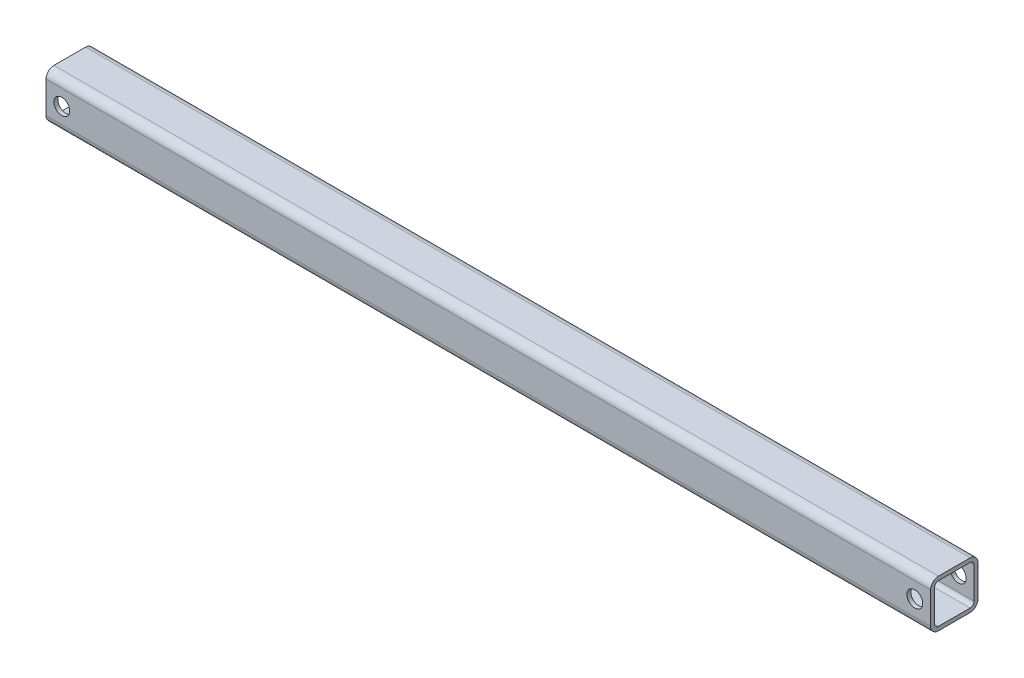
ISO-10303-21;
HEADER;
FILE_DESCRIPTION(('STEP AP214'),'2;1');
FILE_NAME('part.step','',(''),(''),'','','');
FILE_SCHEMA(('AUTOMOTIVE_DESIGN { 1 0 10303 214 1 1 1 1 }'));
ENDSEC;
DATA;
#1=APPLICATION_CONTEXT('core data for automotive mechanical design processes');
#2=APPLICATION_PROTOCOL_DEFINITION('international standard','automotive_design',2000,#1);
#3=PRODUCT_CONTEXT('',#1,'mechanical');
#4=PRODUCT('Part','Part','',(#3));
#5=PRODUCT_RELATED_PRODUCT_CATEGORY('part','',(#4));
#6=PRODUCT_DEFINITION_FORMATION('','',#4);
#7=PRODUCT_DEFINITION_CONTEXT('part definition',#1,'design');
#8=PRODUCT_DEFINITION('design','',#6,#7);
#9=PRODUCT_DEFINITION_SHAPE('','',#8);
#10=(LENGTH_UNIT() NAMED_UNIT(*) SI_UNIT(.MILLI.,.METRE.));
#11=(NAMED_UNIT(*) PLANE_ANGLE_UNIT() SI_UNIT($,.RADIAN.));
#12=(NAMED_UNIT(*) SI_UNIT($,.STERADIAN.) SOLID_ANGLE_UNIT());
#13=UNCERTAINTY_MEASURE_WITH_UNIT(LENGTH_MEASURE(1.E-05),#10,'distance_accuracy_value','');
#14=(GEOMETRIC_REPRESENTATION_CONTEXT(3) GLOBAL_UNCERTAINTY_ASSIGNED_CONTEXT((#13)) GLOBAL_UNIT_ASSIGNED_CONTEXT((#10,
#11,#12)) REPRESENTATION_CONTEXT('',''));
#15=CARTESIAN_POINT('',(0.,0.,0.));
#16=DIRECTION('',(0.,0.,1.));
#17=DIRECTION('',(1.,0.,0.));
#18=AXIS2_PLACEMENT_3D('',#15,#16,#17);
#19=CARTESIAN_POINT('',(711.2,12.7,-12.7));
#20=DIRECTION('',(-1.,0.,0.));
#21=DIRECTION('',(0.,0.,1.));
#22=AXIS2_PLACEMENT_3D('',#19,#20,#21);
#23=CYLINDRICAL_SURFACE('',#22,6.35);
#24=CARTESIAN_POINT('',(0.,12.7,-12.7));
#25=DIRECTION('',(1.,0.,0.));
#26=DIRECTION('',(0.,0.,-1.));
#27=AXIS2_PLACEMENT_3D('',#24,#25,#26);
#28=CIRCLE('',#27,6.35);
#29=CARTESIAN_POINT('',(0.,12.7,-19.05));
#30=VERTEX_POINT('',#29);
#31=CARTESIAN_POINT('',(0.,19.05,-12.7));
#32=VERTEX_POINT('',#31);
#33=EDGE_CURVE('E236',#30,#32,#28,.T.);
#34=ORIENTED_EDGE('',*,*,#33,.T.);
#35=DIRECTION('',(-1.,0.,0.));
#36=VECTOR('',#35,1.);
#37=CARTESIAN_POINT('',(711.2,19.05,-12.7));
#38=LINE('',#37,#36);
#39=CARTESIAN_POINT('',(711.2,19.05,-12.7));
#40=VERTEX_POINT('',#39);
#41=EDGE_CURVE('E12',#40,#32,#38,.T.);
#42=ORIENTED_EDGE('',*,*,#41,.F.);
#43=CARTESIAN_POINT('',(711.2,12.7,-12.7));
#44=DIRECTION('',(1.,0.,0.));
#45=DIRECTION('',(0.,0.,-1.));
#46=AXIS2_PLACEMENT_3D('',#43,#44,#45);
#47=CIRCLE('',#46,6.35);
#48=CARTESIAN_POINT('',(711.2,12.7,-19.05));
#49=VERTEX_POINT('',#48);
#50=EDGE_CURVE('E314',#49,#40,#47,.T.);
#51=ORIENTED_EDGE('',*,*,#50,.F.);
#52=DIRECTION('',(-1.,0.,0.));
#53=VECTOR('',#52,1.);
#54=CARTESIAN_POINT('',(711.2,12.7,-19.05));
#55=LINE('',#54,#53);
#56=EDGE_CURVE('E251',#49,#30,#55,.T.);
#57=ORIENTED_EDGE('',*,*,#56,.T.);
#58=EDGE_LOOP('',(#34,#42,#51,#57));
#59=FACE_BOUND('',#58,.T.);
#60=ADVANCED_FACE('F63',(#59),#23,.T.);
#61=CARTESIAN_POINT('',(711.2,19.05,-12.7));
#62=DIRECTION('',(0.,-1.,0.));
#63=DIRECTION('',(0.,0.,-1.));
#64=AXIS2_PLACEMENT_3D('',#61,#62,#63);
#65=PLANE('',#64);
#66=DIRECTION('',(0.,0.,1.));
#67=VECTOR('',#66,1.);
#68=CARTESIAN_POINT('',(0.,19.05,-12.7));
#69=LINE('',#68,#67);
#70=CARTESIAN_POINT('',(0.,19.05,12.7));
#71=VERTEX_POINT('',#70);
#72=EDGE_CURVE('E239',#32,#71,#69,.T.);
#73=ORIENTED_EDGE('',*,*,#72,.T.);
#74=DIRECTION('',(-1.,0.,0.));
#75=VECTOR('',#74,1.);
#76=CARTESIAN_POINT('',(711.2,19.05,12.7));
#77=LINE('',#76,#75);
#78=CARTESIAN_POINT('',(711.2,19.05,12.7));
#79=VERTEX_POINT('',#78);
#80=EDGE_CURVE('E73',#79,#71,#77,.T.);
#81=ORIENTED_EDGE('',*,*,#80,.F.);
#82=DIRECTION('',(0.,0.,1.));
#83=VECTOR('',#82,1.);
#84=CARTESIAN_POINT('',(711.2,19.05,-12.7));
#85=LINE('',#84,#83);
#86=EDGE_CURVE('E316',#40,#79,#85,.T.);
#87=ORIENTED_EDGE('',*,*,#86,.F.);
#88=ORIENTED_EDGE('',*,*,#41,.T.);
#89=EDGE_LOOP('',(#73,#81,#87,#88));
#90=FACE_BOUND('',#89,.T.);
#91=ADVANCED_FACE('F354',(#90),#65,.F.);
#92=CARTESIAN_POINT('',(711.2,12.7,12.7));
#93=DIRECTION('',(-1.,0.,0.));
#94=DIRECTION('',(0.,0.,1.));
#95=AXIS2_PLACEMENT_3D('',#92,#93,#94);
#96=CYLINDRICAL_SURFACE('',#95,6.35);
#97=CARTESIAN_POINT('',(0.,12.7,12.7));
#98=DIRECTION('',(1.,0.,0.));
#99=DIRECTION('',(0.,0.,-1.));
#100=AXIS2_PLACEMENT_3D('',#97,#98,#99);
#101=CIRCLE('',#100,6.35);
#102=CARTESIAN_POINT('',(0.,12.7,19.05));
#103=VERTEX_POINT('',#102);
#104=EDGE_CURVE('E241',#71,#103,#101,.T.);
#105=ORIENTED_EDGE('',*,*,#104,.T.);
#106=DIRECTION('',(-1.,0.,0.));
#107=VECTOR('',#106,1.);
#108=CARTESIAN_POINT('',(711.2,12.7,19.05));
#109=LINE('',#108,#107);
#110=CARTESIAN_POINT('',(711.2,12.7,19.05));
#111=VERTEX_POINT('',#110);
#112=EDGE_CURVE('E258',#111,#103,#109,.T.);
#113=ORIENTED_EDGE('',*,*,#112,.F.);
#114=CARTESIAN_POINT('',(711.2,12.7,12.7));
#115=DIRECTION('',(1.,0.,0.));
#116=DIRECTION('',(0.,0.,-1.));
#117=AXIS2_PLACEMENT_3D('',#114,#115,#116);
#118=CIRCLE('',#117,6.35);
#119=EDGE_CURVE('E318',#79,#111,#118,.T.);
#120=ORIENTED_EDGE('',*,*,#119,.F.);
#121=ORIENTED_EDGE('',*,*,#80,.T.);
#122=EDGE_LOOP('',(#105,#113,#120,#121));
#123=FACE_BOUND('',#122,.T.);
#124=ADVANCED_FACE('F359',(#123),#96,.T.);
#125=CARTESIAN_POINT('',(711.2,-12.7,19.05));
#126=DIRECTION('',(0.,0.,-1.));
#127=DIRECTION('',(0.,1.,0.));
#128=AXIS2_PLACEMENT_3D('',#125,#126,#127);
#129=PLANE('',#128);
#130=CARTESIAN_POINT('',(698.5,0.,19.05));
#131=DIRECTION('',(0.,0.,1.));
#132=DIRECTION('',(1.,0.,0.));
#133=AXIS2_PLACEMENT_3D('',#130,#131,#132);
#134=CIRCLE('',#133,6.34999999999994);
#135=CARTESIAN_POINT('',(704.85,0.,19.05));
#136=VERTEX_POINT('',#135);
#137=EDGE_CURVE('E525',#136,#136,#134,.T.);
#138=ORIENTED_EDGE('',*,*,#137,.F.);
#139=EDGE_LOOP('',(#138));
#140=FACE_BOUND('',#139,.T.);
#141=CARTESIAN_POINT('',(12.7,0.,19.05));
#142=DIRECTION('',(0.,0.,1.));
#143=DIRECTION('',(1.,0.,0.));
#144=AXIS2_PLACEMENT_3D('',#141,#142,#143);
#145=CIRCLE('',#144,6.35);
#146=CARTESIAN_POINT('',(19.05,0.,19.05));
#147=VERTEX_POINT('',#146);
#148=EDGE_CURVE('E534',#147,#147,#145,.T.);
#149=ORIENTED_EDGE('',*,*,#148,.F.);
#150=EDGE_LOOP('',(#149));
#151=FACE_BOUND('',#150,.T.);
#152=DIRECTION('',(0.,-1.,0.));
#153=VECTOR('',#152,1.);
#154=CARTESIAN_POINT('',(0.,-12.7,19.05));
#155=LINE('',#154,#153);
#156=CARTESIAN_POINT('',(0.,-12.7,19.05));
#157=VERTEX_POINT('',#156);
#158=EDGE_CURVE('E243',#103,#157,#155,.T.);
#159=ORIENTED_EDGE('',*,*,#158,.T.);
#160=DIRECTION('',(-1.,0.,0.));
#161=VECTOR('',#160,1.);
#162=CARTESIAN_POINT('',(711.2,-12.7,19.05));
#163=LINE('',#162,#161);
#164=CARTESIAN_POINT('',(711.2,-12.7,19.05));
#165=VERTEX_POINT('',#164);
#166=EDGE_CURVE('E255',#165,#157,#163,.T.);
#167=ORIENTED_EDGE('',*,*,#166,.F.);
#168=DIRECTION('',(0.,-1.,0.));
#169=VECTOR('',#168,1.);
#170=CARTESIAN_POINT('',(711.2,-12.7,19.05));
#171=LINE('',#170,#169);
#172=EDGE_CURVE('E320',#111,#165,#171,.T.);
#173=ORIENTED_EDGE('',*,*,#172,.F.);
#174=ORIENTED_EDGE('',*,*,#112,.T.);
#175=EDGE_LOOP('',(#159,#167,#173,#174));
#176=FACE_BOUND('',#175,.T.);
#177=ADVANCED_FACE('F326',(#140,#151,#176),#129,.F.);
#178=CARTESIAN_POINT('',(711.2,-12.7,12.7));
#179=DIRECTION('',(-1.,0.,0.));
#180=DIRECTION('',(0.,0.,1.));
#181=AXIS2_PLACEMENT_3D('',#178,#179,#180);
#182=CYLINDRICAL_SURFACE('',#181,6.35);
#183=CARTESIAN_POINT('',(0.,-12.7,12.7));
#184=DIRECTION('',(1.,0.,0.));
#185=DIRECTION('',(0.,0.,-1.));
#186=AXIS2_PLACEMENT_3D('',#183,#184,#185);
#187=CIRCLE('',#186,6.35);
#188=CARTESIAN_POINT('',(0.,-19.05,12.7));
#189=VERTEX_POINT('',#188);
#190=EDGE_CURVE('E245',#157,#189,#187,.T.);
#191=ORIENTED_EDGE('',*,*,#190,.T.);
#192=DIRECTION('',(-1.,0.,0.));
#193=VECTOR('',#192,1.);
#194=CARTESIAN_POINT('',(711.2,-19.05,12.7));
#195=LINE('',#194,#193);
#196=CARTESIAN_POINT('',(711.2,-19.05,12.7));
#197=VERTEX_POINT('',#196);
#198=EDGE_CURVE('E202',#197,#189,#195,.T.);
#199=ORIENTED_EDGE('',*,*,#198,.F.);
#200=CARTESIAN_POINT('',(711.2,-12.7,12.7));
#201=DIRECTION('',(1.,0.,0.));
#202=DIRECTION('',(0.,0.,-1.));
#203=AXIS2_PLACEMENT_3D('',#200,#201,#202);
#204=CIRCLE('',#203,6.35);
#205=EDGE_CURVE('E193',#165,#197,#204,.T.);
#206=ORIENTED_EDGE('',*,*,#205,.F.);
#207=ORIENTED_EDGE('',*,*,#166,.T.);
#208=EDGE_LOOP('',(#191,#199,#206,#207));
#209=FACE_BOUND('',#208,.T.);
#210=ADVANCED_FACE('F330',(#209),#182,.T.);
#211=CARTESIAN_POINT('',(711.2,-19.05,12.7));
#212=DIRECTION('',(0.,1.,0.));
#213=DIRECTION('',(0.,0.,1.));
#214=AXIS2_PLACEMENT_3D('',#211,#212,#213);
#215=PLANE('',#214);
#216=DIRECTION('',(0.,0.,-1.));
#217=VECTOR('',#216,1.);
#218=CARTESIAN_POINT('',(0.,-19.05,12.7));
#219=LINE('',#218,#217);
#220=CARTESIAN_POINT('',(0.,-19.05,-12.7));
#221=VERTEX_POINT('',#220);
#222=EDGE_CURVE('E201',#189,#221,#219,.T.);
#223=ORIENTED_EDGE('',*,*,#222,.T.);
#224=DIRECTION('',(-1.,0.,0.));
#225=VECTOR('',#224,1.);
#226=CARTESIAN_POINT('',(711.2,-19.05,-12.7));
#227=LINE('',#226,#225);
#228=CARTESIAN_POINT('',(711.2,-19.05,-12.7));
#229=VERTEX_POINT('',#228);
#230=EDGE_CURVE('E198',#229,#221,#227,.T.);
#231=ORIENTED_EDGE('',*,*,#230,.F.);
#232=DIRECTION('',(0.,0.,-1.));
#233=VECTOR('',#232,1.);
#234=CARTESIAN_POINT('',(711.2,-19.05,12.7));
#235=LINE('',#234,#233);
#236=EDGE_CURVE('E187',#197,#229,#235,.T.);
#237=ORIENTED_EDGE('',*,*,#236,.F.);
#238=ORIENTED_EDGE('',*,*,#198,.T.);
#239=EDGE_LOOP('',(#223,#231,#237,#238));
#240=FACE_BOUND('',#239,.T.);
#241=ADVANCED_FACE('F199',(#240),#215,.F.);
#242=CARTESIAN_POINT('',(711.2,-12.7,-12.7));
#243=DIRECTION('',(-1.,0.,0.));
#244=DIRECTION('',(0.,0.,1.));
#245=AXIS2_PLACEMENT_3D('',#242,#243,#244);
#246=CYLINDRICAL_SURFACE('',#245,6.35);
#247=CARTESIAN_POINT('',(0.,-12.7,-12.7));
#248=DIRECTION('',(1.,0.,0.));
#249=DIRECTION('',(0.,0.,-1.));
#250=AXIS2_PLACEMENT_3D('',#247,#248,#249);
#251=CIRCLE('',#250,6.35);
#252=CARTESIAN_POINT('',(0.,-12.7,-19.05));
#253=VERTEX_POINT('',#252);
#254=EDGE_CURVE('E135',#221,#253,#251,.T.);
#255=ORIENTED_EDGE('',*,*,#254,.T.);
#256=DIRECTION('',(-1.,0.,0.));
#257=VECTOR('',#256,1.);
#258=CARTESIAN_POINT('',(711.2,-12.7,-19.05));
#259=LINE('',#258,#257);
#260=CARTESIAN_POINT('',(711.2,-12.7,-19.05));
#261=VERTEX_POINT('',#260);
#262=EDGE_CURVE('E203',#261,#253,#259,.T.);
#263=ORIENTED_EDGE('',*,*,#262,.F.);
#264=CARTESIAN_POINT('',(711.2,-12.7,-12.7));
#265=DIRECTION('',(1.,0.,0.));
#266=DIRECTION('',(0.,0.,-1.));
#267=AXIS2_PLACEMENT_3D('',#264,#265,#266);
#268=CIRCLE('',#267,6.35);
#269=EDGE_CURVE('E191',#229,#261,#268,.T.);
#270=ORIENTED_EDGE('',*,*,#269,.F.);
#271=ORIENTED_EDGE('',*,*,#230,.T.);
#272=EDGE_LOOP('',(#255,#263,#270,#271));
#273=FACE_BOUND('',#272,.T.);
#274=ADVANCED_FACE('F205',(#273),#246,.T.);
#275=CARTESIAN_POINT('',(711.2,12.7,12.7));
#276=DIRECTION('',(-1.,0.,0.));
#277=DIRECTION('',(0.,0.,1.));
#278=AXIS2_PLACEMENT_3D('',#275,#276,#277);
#279=CYLINDRICAL_SURFACE('',#278,3.175);
#280=CARTESIAN_POINT('',(0.,12.7,12.7));
#281=DIRECTION('',(1.,0.,0.));
#282=DIRECTION('',(0.,0.,-1.));
#283=AXIS2_PLACEMENT_3D('',#280,#281,#282);
#284=CIRCLE('',#283,3.175);
#285=CARTESIAN_POINT('',(0.,15.875,12.7));
#286=VERTEX_POINT('',#285);
#287=CARTESIAN_POINT('',(0.,12.7,15.875));
#288=VERTEX_POINT('',#287);
#289=EDGE_CURVE('E211',#286,#288,#284,.T.);
#290=ORIENTED_EDGE('',*,*,#289,.F.);
#291=DIRECTION('',(-1.,0.,0.));
#292=VECTOR('',#291,1.);
#293=CARTESIAN_POINT('',(711.2,15.875,12.7));
#294=LINE('',#293,#292);
#295=CARTESIAN_POINT('',(711.2,15.875,12.7));
#296=VERTEX_POINT('',#295);
#297=EDGE_CURVE('E67',#296,#286,#294,.T.);
#298=ORIENTED_EDGE('',*,*,#297,.F.);
#299=CARTESIAN_POINT('',(711.2,12.7,12.7));
#300=DIRECTION('',(1.,0.,0.));
#301=DIRECTION('',(0.,0.,-1.));
#302=AXIS2_PLACEMENT_3D('',#299,#300,#301);
#303=CIRCLE('',#302,3.175);
#304=CARTESIAN_POINT('',(711.2,12.7,15.875));
#305=VERTEX_POINT('',#304);
#306=EDGE_CURVE('E250',#296,#305,#303,.T.);
#307=ORIENTED_EDGE('',*,*,#306,.T.);
#308=DIRECTION('',(-1.,0.,0.));
#309=VECTOR('',#308,1.);
#310=CARTESIAN_POINT('',(711.2,12.7,15.875));
#311=LINE('',#310,#309);
#312=EDGE_CURVE('E207',#305,#288,#311,.T.);
#313=ORIENTED_EDGE('',*,*,#312,.T.);
#314=EDGE_LOOP('',(#290,#298,#307,#313));
#315=FACE_BOUND('',#314,.T.);
#316=ADVANCED_FACE('F65',(#315),#279,.F.);
#317=CARTESIAN_POINT('',(711.2,15.875,-12.7));
#318=DIRECTION('',(0.,-1.,0.));
#319=DIRECTION('',(0.,0.,-1.));
#320=AXIS2_PLACEMENT_3D('',#317,#318,#319);
#321=PLANE('',#320);
#322=DIRECTION('',(0.,0.,1.));
#323=VECTOR('',#322,1.);
#324=CARTESIAN_POINT('',(0.,15.875,-12.7));
#325=LINE('',#324,#323);
#326=CARTESIAN_POINT('',(0.,15.875,-12.7));
#327=VERTEX_POINT('',#326);
#328=EDGE_CURVE('E214',#327,#286,#325,.T.);
#329=ORIENTED_EDGE('',*,*,#328,.F.);
#330=DIRECTION('',(-1.,0.,0.));
#331=VECTOR('',#330,1.);
#332=CARTESIAN_POINT('',(711.2,15.875,-12.7));
#333=LINE('',#332,#331);
#334=CARTESIAN_POINT('',(711.2,15.875,-12.7));
#335=VERTEX_POINT('',#334);
#336=EDGE_CURVE('E273',#335,#327,#333,.T.);
#337=ORIENTED_EDGE('',*,*,#336,.F.);
#338=DIRECTION('',(0.,0.,1.));
#339=VECTOR('',#338,1.);
#340=CARTESIAN_POINT('',(711.2,15.875,-12.7));
#341=LINE('',#340,#339);
#342=EDGE_CURVE('E282',#335,#296,#341,.T.);
#343=ORIENTED_EDGE('',*,*,#342,.T.);
#344=ORIENTED_EDGE('',*,*,#297,.T.);
#345=EDGE_LOOP('',(#329,#337,#343,#344));
#346=FACE_BOUND('',#345,.T.);
#347=ADVANCED_FACE('F280',(#346),#321,.T.);
#348=CARTESIAN_POINT('',(711.2,12.7,-12.7));
#349=DIRECTION('',(-1.,0.,0.));
#350=DIRECTION('',(0.,0.,1.));
#351=AXIS2_PLACEMENT_3D('',#348,#349,#350);
#352=CYLINDRICAL_SURFACE('',#351,3.175);
#353=CARTESIAN_POINT('',(0.,12.7,-12.7));
#354=DIRECTION('',(1.,0.,0.));
#355=DIRECTION('',(0.,0.,-1.));
#356=AXIS2_PLACEMENT_3D('',#353,#354,#355);
#357=CIRCLE('',#356,3.175);
#358=CARTESIAN_POINT('',(0.,12.7,-15.875));
#359=VERTEX_POINT('',#358);
#360=EDGE_CURVE('E218',#359,#327,#357,.T.);
#361=ORIENTED_EDGE('',*,*,#360,.F.);
#362=DIRECTION('',(-1.,0.,0.));
#363=VECTOR('',#362,1.);
#364=CARTESIAN_POINT('',(711.2,12.7,-15.875));
#365=LINE('',#364,#363);
#366=CARTESIAN_POINT('',(711.2,12.7,-15.875));
#367=VERTEX_POINT('',#366);
#368=EDGE_CURVE('E272',#367,#359,#365,.T.);
#369=ORIENTED_EDGE('',*,*,#368,.F.);
#370=CARTESIAN_POINT('',(711.2,12.7,-12.7));
#371=DIRECTION('',(1.,0.,0.));
#372=DIRECTION('',(0.,0.,-1.));
#373=AXIS2_PLACEMENT_3D('',#370,#371,#372);
#374=CIRCLE('',#373,3.175);
#375=EDGE_CURVE('E290',#367,#335,#374,.T.);
#376=ORIENTED_EDGE('',*,*,#375,.T.);
#377=ORIENTED_EDGE('',*,*,#336,.T.);
#378=EDGE_LOOP('',(#361,#369,#376,#377));
#379=FACE_BOUND('',#378,.T.);
#380=ADVANCED_FACE('F288',(#379),#352,.F.);
#381=CARTESIAN_POINT('',(711.2,12.7,-15.875));
#382=DIRECTION('',(0.,0.,1.));
#383=DIRECTION('',(1.,0.,0.));
#384=AXIS2_PLACEMENT_3D('',#381,#382,#383);
#385=PLANE('',#384);
#386=CARTESIAN_POINT('',(698.5,0.,-15.875));
#387=DIRECTION('',(0.,0.,1.));
#388=DIRECTION('',(1.,0.,0.));
#389=AXIS2_PLACEMENT_3D('',#386,#387,#388);
#390=CIRCLE('',#389,6.34999999999994);
#391=CARTESIAN_POINT('',(704.85,0.,-15.875));
#392=VERTEX_POINT('',#391);
#393=EDGE_CURVE('E531',#392,#392,#390,.T.);
#394=ORIENTED_EDGE('',*,*,#393,.F.);
#395=EDGE_LOOP('',(#394));
#396=FACE_BOUND('',#395,.T.);
#397=CARTESIAN_POINT('',(12.7,0.,-15.875));
#398=DIRECTION('',(0.,0.,1.));
#399=DIRECTION('',(1.,0.,0.));
#400=AXIS2_PLACEMENT_3D('',#397,#398,#399);
#401=CIRCLE('',#400,6.35);
#402=CARTESIAN_POINT('',(19.05,0.,-15.875));
#403=VERTEX_POINT('',#402);
#404=EDGE_CURVE('E215',#403,#403,#401,.T.);
#405=ORIENTED_EDGE('',*,*,#404,.F.);
#406=EDGE_LOOP('',(#405));
#407=FACE_BOUND('',#406,.T.);
#408=DIRECTION('',(0.,1.,0.));
#409=VECTOR('',#408,1.);
#410=CARTESIAN_POINT('',(0.,12.7,-15.875));
#411=LINE('',#410,#409);
#412=CARTESIAN_POINT('',(0.,-12.7,-15.875));
#413=VERTEX_POINT('',#412);
#414=EDGE_CURVE('E221',#413,#359,#411,.T.);
#415=ORIENTED_EDGE('',*,*,#414,.F.);
#416=DIRECTION('',(-1.,0.,0.));
#417=VECTOR('',#416,1.);
#418=CARTESIAN_POINT('',(711.2,-12.7,-15.875));
#419=LINE('',#418,#417);
#420=CARTESIAN_POINT('',(711.2,-12.7,-15.875));
#421=VERTEX_POINT('',#420);
#422=EDGE_CURVE('E270',#421,#413,#419,.T.);
#423=ORIENTED_EDGE('',*,*,#422,.F.);
#424=DIRECTION('',(0.,1.,0.));
#425=VECTOR('',#424,1.);
#426=CARTESIAN_POINT('',(711.2,12.7,-15.875));
#427=LINE('',#426,#425);
#428=EDGE_CURVE('E296',#421,#367,#427,.T.);
#429=ORIENTED_EDGE('',*,*,#428,.T.);
#430=ORIENTED_EDGE('',*,*,#368,.T.);
#431=EDGE_LOOP('',(#415,#423,#429,#430));
#432=FACE_BOUND('',#431,.T.);
#433=ADVANCED_FACE('F299',(#396,#407,#432),#385,.T.);
#434=CARTESIAN_POINT('',(711.2,-12.7,-12.7));
#435=DIRECTION('',(-1.,0.,0.));
#436=DIRECTION('',(0.,0.,1.));
#437=AXIS2_PLACEMENT_3D('',#434,#435,#436);
#438=CYLINDRICAL_SURFACE('',#437,3.175);
#439=CARTESIAN_POINT('',(0.,-12.7,-12.7));
#440=DIRECTION('',(1.,0.,0.));
#441=DIRECTION('',(0.,0.,-1.));
#442=AXIS2_PLACEMENT_3D('',#439,#440,#441);
#443=CIRCLE('',#442,3.175);
#444=CARTESIAN_POINT('',(0.,-15.875,-12.7));
#445=VERTEX_POINT('',#444);
#446=EDGE_CURVE('E224',#445,#413,#443,.T.);
#447=ORIENTED_EDGE('',*,*,#446,.F.);
#448=DIRECTION('',(-1.,0.,0.));
#449=VECTOR('',#448,1.);
#450=CARTESIAN_POINT('',(711.2,-15.875,-12.7));
#451=LINE('',#450,#449);
#452=CARTESIAN_POINT('',(711.2,-15.875,-12.7));
#453=VERTEX_POINT('',#452);
#454=EDGE_CURVE('E268',#453,#445,#451,.T.);
#455=ORIENTED_EDGE('',*,*,#454,.F.);
#456=CARTESIAN_POINT('',(711.2,-12.7,-12.7));
#457=DIRECTION('',(1.,0.,0.));
#458=DIRECTION('',(0.,0.,-1.));
#459=AXIS2_PLACEMENT_3D('',#456,#457,#458);
#460=CIRCLE('',#459,3.175);
#461=EDGE_CURVE('E300',#453,#421,#460,.T.);
#462=ORIENTED_EDGE('',*,*,#461,.T.);
#463=ORIENTED_EDGE('',*,*,#422,.T.);
#464=EDGE_LOOP('',(#447,#455,#462,#463));
#465=FACE_BOUND('',#464,.T.);
#466=ADVANCED_FACE('F370',(#465),#438,.F.);
#467=CARTESIAN_POINT('',(711.2,-15.875,12.7));
#468=DIRECTION('',(0.,1.,0.));
#469=DIRECTION('',(0.,0.,1.));
#470=AXIS2_PLACEMENT_3D('',#467,#468,#469);
#471=PLANE('',#470);
#472=DIRECTION('',(0.,0.,-1.));
#473=VECTOR('',#472,1.);
#474=CARTESIAN_POINT('',(0.,-15.875,12.7));
#475=LINE('',#474,#473);
#476=CARTESIAN_POINT('',(0.,-15.875,12.7));
#477=VERTEX_POINT('',#476);
#478=EDGE_CURVE('E227',#477,#445,#475,.T.);
#479=ORIENTED_EDGE('',*,*,#478,.F.);
#480=DIRECTION('',(-1.,0.,0.));
#481=VECTOR('',#480,1.);
#482=CARTESIAN_POINT('',(711.2,-15.875,12.7));
#483=LINE('',#482,#481);
#484=CARTESIAN_POINT('',(711.2,-15.875,12.7));
#485=VERTEX_POINT('',#484);
#486=EDGE_CURVE('E266',#485,#477,#483,.T.);
#487=ORIENTED_EDGE('',*,*,#486,.F.);
#488=DIRECTION('',(0.,0.,-1.));
#489=VECTOR('',#488,1.);
#490=CARTESIAN_POINT('',(711.2,-15.875,12.7));
#491=LINE('',#490,#489);
#492=EDGE_CURVE('E302',#485,#453,#491,.T.);
#493=ORIENTED_EDGE('',*,*,#492,.T.);
#494=ORIENTED_EDGE('',*,*,#454,.T.);
#495=EDGE_LOOP('',(#479,#487,#493,#494));
#496=FACE_BOUND('',#495,.T.);
#497=ADVANCED_FACE('F366',(#496),#471,.T.);
#498=CARTESIAN_POINT('',(711.2,-12.7,12.7));
#499=DIRECTION('',(-1.,0.,0.));
#500=DIRECTION('',(0.,0.,1.));
#501=AXIS2_PLACEMENT_3D('',#498,#499,#500);
#502=CYLINDRICAL_SURFACE('',#501,3.175);
#503=CARTESIAN_POINT('',(0.,-12.7,12.7));
#504=DIRECTION('',(1.,0.,0.));
#505=DIRECTION('',(0.,0.,-1.));
#506=AXIS2_PLACEMENT_3D('',#503,#504,#505);
#507=CIRCLE('',#506,3.175);
#508=CARTESIAN_POINT('',(0.,-12.7,15.875));
#509=VERTEX_POINT('',#508);
#510=EDGE_CURVE('E230',#509,#477,#507,.T.);
#511=ORIENTED_EDGE('',*,*,#510,.F.);
#512=DIRECTION('',(-1.,0.,0.));
#513=VECTOR('',#512,1.);
#514=CARTESIAN_POINT('',(711.2,-12.7,15.875));
#515=LINE('',#514,#513);
#516=CARTESIAN_POINT('',(711.2,-12.7,15.875));
#517=VERTEX_POINT('',#516);
#518=EDGE_CURVE('E264',#517,#509,#515,.T.);
#519=ORIENTED_EDGE('',*,*,#518,.F.);
#520=CARTESIAN_POINT('',(711.2,-12.7,12.7));
#521=DIRECTION('',(1.,0.,0.));
#522=DIRECTION('',(0.,0.,-1.));
#523=AXIS2_PLACEMENT_3D('',#520,#521,#522);
#524=CIRCLE('',#523,3.175);
#525=EDGE_CURVE('E308',#517,#485,#524,.T.);
#526=ORIENTED_EDGE('',*,*,#525,.T.);
#527=ORIENTED_EDGE('',*,*,#486,.T.);
#528=EDGE_LOOP('',(#511,#519,#526,#527));
#529=FACE_BOUND('',#528,.T.);
#530=ADVANCED_FACE('F346',(#529),#502,.F.);
#531=CARTESIAN_POINT('',(711.2,-12.7,15.875));
#532=DIRECTION('',(0.,0.,-1.));
#533=DIRECTION('',(0.,1.,0.));
#534=AXIS2_PLACEMENT_3D('',#531,#532,#533);
#535=PLANE('',#534);
#536=CARTESIAN_POINT('',(698.5,0.,15.875));
#537=DIRECTION('',(0.,0.,-1.));
#538=DIRECTION('',(0.,1.,0.));
#539=AXIS2_PLACEMENT_3D('',#536,#537,#538);
#540=CIRCLE('',#539,6.34999999999994);
#541=CARTESIAN_POINT('',(698.5,6.34999999999994,15.875));
#542=VERTEX_POINT('',#541);
#543=EDGE_CURVE('E522',#542,#542,#540,.T.);
#544=ORIENTED_EDGE('',*,*,#543,.F.);
#545=EDGE_LOOP('',(#544));
#546=FACE_BOUND('',#545,.T.);
#547=CARTESIAN_POINT('',(12.7,0.,15.875));
#548=DIRECTION('',(0.,0.,-1.));
#549=DIRECTION('',(0.,1.,0.));
#550=AXIS2_PLACEMENT_3D('',#547,#548,#549);
#551=CIRCLE('',#550,6.35);
#552=CARTESIAN_POINT('',(12.7,6.35,15.875));
#553=VERTEX_POINT('',#552);
#554=EDGE_CURVE('E538',#553,#553,#551,.T.);
#555=ORIENTED_EDGE('',*,*,#554,.F.);
#556=EDGE_LOOP('',(#555));
#557=FACE_BOUND('',#556,.T.);
#558=DIRECTION('',(0.,-1.,0.));
#559=VECTOR('',#558,1.);
#560=CARTESIAN_POINT('',(0.,-12.7,15.875));
#561=LINE('',#560,#559);
#562=EDGE_CURVE('E233',#288,#509,#561,.T.);
#563=ORIENTED_EDGE('',*,*,#562,.F.);
#564=ORIENTED_EDGE('',*,*,#312,.F.);
#565=DIRECTION('',(0.,-1.,0.));
#566=VECTOR('',#565,1.);
#567=CARTESIAN_POINT('',(711.2,-12.7,15.875));
#568=LINE('',#567,#566);
#569=EDGE_CURVE('E311',#305,#517,#568,.T.);
#570=ORIENTED_EDGE('',*,*,#569,.T.);
#571=ORIENTED_EDGE('',*,*,#518,.T.);
#572=EDGE_LOOP('',(#563,#564,#570,#571));
#573=FACE_BOUND('',#572,.T.);
#574=ADVANCED_FACE('F338',(#546,#557,#573),#535,.T.);
#575=CARTESIAN_POINT('',(711.2,12.7,-19.05));
#576=DIRECTION('',(0.,0.,1.));
#577=DIRECTION('',(1.,0.,0.));
#578=AXIS2_PLACEMENT_3D('',#575,#576,#577);
#579=PLANE('',#578);
#580=CARTESIAN_POINT('',(698.5,0.,-19.05));
#581=DIRECTION('',(0.,0.,1.));
#582=DIRECTION('',(1.,0.,0.));
#583=AXIS2_PLACEMENT_3D('',#580,#581,#582);
#584=CIRCLE('',#583,6.34999999999994);
#585=CARTESIAN_POINT('',(704.85,0.,-19.05));
#586=VERTEX_POINT('',#585);
#587=EDGE_CURVE('E526',#586,#586,#584,.T.);
#588=ORIENTED_EDGE('',*,*,#587,.T.);
#589=EDGE_LOOP('',(#588));
#590=FACE_BOUND('',#589,.T.);
#591=CARTESIAN_POINT('',(12.7,0.,-19.05));
#592=DIRECTION('',(0.,0.,1.));
#593=DIRECTION('',(1.,0.,0.));
#594=AXIS2_PLACEMENT_3D('',#591,#592,#593);
#595=CIRCLE('',#594,6.35);
#596=CARTESIAN_POINT('',(19.05,0.,-19.05));
#597=VERTEX_POINT('',#596);
#598=EDGE_CURVE('E535',#597,#597,#595,.T.);
#599=ORIENTED_EDGE('',*,*,#598,.T.);
#600=EDGE_LOOP('',(#599));
#601=FACE_BOUND('',#600,.T.);
#602=DIRECTION('',(0.,1.,0.));
#603=VECTOR('',#602,1.);
#604=CARTESIAN_POINT('',(0.,12.7,-19.05));
#605=LINE('',#604,#603);
#606=EDGE_CURVE('E141',#253,#30,#605,.T.);
#607=ORIENTED_EDGE('',*,*,#606,.T.);
#608=ORIENTED_EDGE('',*,*,#56,.F.);
#609=DIRECTION('',(0.,1.,0.));
#610=VECTOR('',#609,1.);
#611=CARTESIAN_POINT('',(711.2,12.7,-19.05));
#612=LINE('',#611,#610);
#613=EDGE_CURVE('E82',#261,#49,#612,.T.);
#614=ORIENTED_EDGE('',*,*,#613,.F.);
#615=ORIENTED_EDGE('',*,*,#262,.T.);
#616=EDGE_LOOP('',(#607,#608,#614,#615));
#617=FACE_BOUND('',#616,.T.);
#618=ADVANCED_FACE('F336',(#590,#601,#617),#579,.F.);
#619=CARTESIAN_POINT('',(711.2,12.7,-12.7));
#620=DIRECTION('',(1.,0.,0.));
#621=DIRECTION('',(0.,0.,-1.));
#622=AXIS2_PLACEMENT_3D('',#619,#620,#621);
#623=PLANE('',#622);
#624=ORIENTED_EDGE('',*,*,#306,.F.);
#625=ORIENTED_EDGE('',*,*,#342,.F.);
#626=ORIENTED_EDGE('',*,*,#375,.F.);
#627=ORIENTED_EDGE('',*,*,#428,.F.);
#628=ORIENTED_EDGE('',*,*,#461,.F.);
#629=ORIENTED_EDGE('',*,*,#492,.F.);
#630=ORIENTED_EDGE('',*,*,#525,.F.);
#631=ORIENTED_EDGE('',*,*,#569,.F.);
#632=EDGE_LOOP('',(#624,#625,#626,#627,#628,#629,#630,#631));
#633=FACE_BOUND('',#632,.T.);
#634=ORIENTED_EDGE('',*,*,#50,.T.);
#635=ORIENTED_EDGE('',*,*,#86,.T.);
#636=ORIENTED_EDGE('',*,*,#119,.T.);
#637=ORIENTED_EDGE('',*,*,#172,.T.);
#638=ORIENTED_EDGE('',*,*,#205,.T.);
#639=ORIENTED_EDGE('',*,*,#236,.T.);
#640=ORIENTED_EDGE('',*,*,#269,.T.);
#641=ORIENTED_EDGE('',*,*,#613,.T.);
#642=EDGE_LOOP('',(#634,#635,#636,#637,#638,#639,#640,#641));
#643=FACE_BOUND('',#642,.T.);
#644=ADVANCED_FACE('F189',(#633,#643),#623,.T.);
#645=CARTESIAN_POINT('',(0.,12.7,-12.7));
#646=DIRECTION('',(1.,0.,0.));
#647=DIRECTION('',(0.,0.,-1.));
#648=AXIS2_PLACEMENT_3D('',#645,#646,#647);
#649=PLANE('',#648);
#650=ORIENTED_EDGE('',*,*,#289,.T.);
#651=ORIENTED_EDGE('',*,*,#562,.T.);
#652=ORIENTED_EDGE('',*,*,#510,.T.);
#653=ORIENTED_EDGE('',*,*,#478,.T.);
#654=ORIENTED_EDGE('',*,*,#446,.T.);
#655=ORIENTED_EDGE('',*,*,#414,.T.);
#656=ORIENTED_EDGE('',*,*,#360,.T.);
#657=ORIENTED_EDGE('',*,*,#328,.T.);
#658=EDGE_LOOP('',(#650,#651,#652,#653,#654,#655,#656,#657));
#659=FACE_BOUND('',#658,.T.);
#660=ORIENTED_EDGE('',*,*,#33,.F.);
#661=ORIENTED_EDGE('',*,*,#606,.F.);
#662=ORIENTED_EDGE('',*,*,#254,.F.);
#663=ORIENTED_EDGE('',*,*,#222,.F.);
#664=ORIENTED_EDGE('',*,*,#190,.F.);
#665=ORIENTED_EDGE('',*,*,#158,.F.);
#666=ORIENTED_EDGE('',*,*,#104,.F.);
#667=ORIENTED_EDGE('',*,*,#72,.F.);
#668=EDGE_LOOP('',(#660,#661,#662,#663,#664,#665,#666,#667));
#669=FACE_BOUND('',#668,.T.);
#670=ADVANCED_FACE('F285',(#659,#669),#649,.F.);
#671=CARTESIAN_POINT('',(12.7,0.,-19.05));
#672=DIRECTION('',(0.,0.,1.));
#673=DIRECTION('',(1.,0.,0.));
#674=AXIS2_PLACEMENT_3D('',#671,#672,#673);
#675=CYLINDRICAL_SURFACE('',#674,6.35);
#676=ORIENTED_EDGE('',*,*,#404,.T.);
#677=EDGE_LOOP('',(#676));
#678=FACE_BOUND('',#677,.T.);
#679=ORIENTED_EDGE('',*,*,#598,.F.);
#680=EDGE_LOOP('',(#679));
#681=FACE_BOUND('',#680,.T.);
#682=ADVANCED_FACE('F479',(#678,#681),#675,.F.);
#683=ORIENTED_EDGE('',*,*,#554,.T.);
#684=EDGE_LOOP('',(#683));
#685=FACE_BOUND('',#684,.T.);
#686=ORIENTED_EDGE('',*,*,#148,.T.);
#687=EDGE_LOOP('',(#686));
#688=FACE_BOUND('',#687,.T.);
#689=ADVANCED_FACE('F487',(#685,#688),#675,.F.);
#690=CARTESIAN_POINT('',(698.5,0.,-19.05));
#691=DIRECTION('',(0.,0.,1.));
#692=DIRECTION('',(1.,0.,0.));
#693=AXIS2_PLACEMENT_3D('',#690,#691,#692);
#694=CYLINDRICAL_SURFACE('',#693,6.34999999999994);
#695=ORIENTED_EDGE('',*,*,#393,.T.);
#696=EDGE_LOOP('',(#695));
#697=FACE_BOUND('',#696,.T.);
#698=ORIENTED_EDGE('',*,*,#587,.F.);
#699=EDGE_LOOP('',(#698));
#700=FACE_BOUND('',#699,.T.);
#701=ADVANCED_FACE('F496',(#697,#700),#694,.F.);
#702=ORIENTED_EDGE('',*,*,#543,.T.);
#703=EDGE_LOOP('',(#702));
#704=FACE_BOUND('',#703,.T.);
#705=ORIENTED_EDGE('',*,*,#137,.T.);
#706=EDGE_LOOP('',(#705));
#707=FACE_BOUND('',#706,.T.);
#708=ADVANCED_FACE('F506',(#704,#707),#694,.F.);
#709=CLOSED_SHELL('',(#60,#91,#124,#177,#210,#241,#274,#316,#347,#380,#433,#466,#497,#530,#574,
#618,#644,#670,#682,#689,#701,#708));
#710=MANIFOLD_SOLID_BREP('B2',#709);
#711=ADVANCED_BREP_SHAPE_REPRESENTATION('',(#18,#710),#14);
#712=SHAPE_DEFINITION_REPRESENTATION(#9,#711);
ENDSEC;
END-ISO-10303-21;
